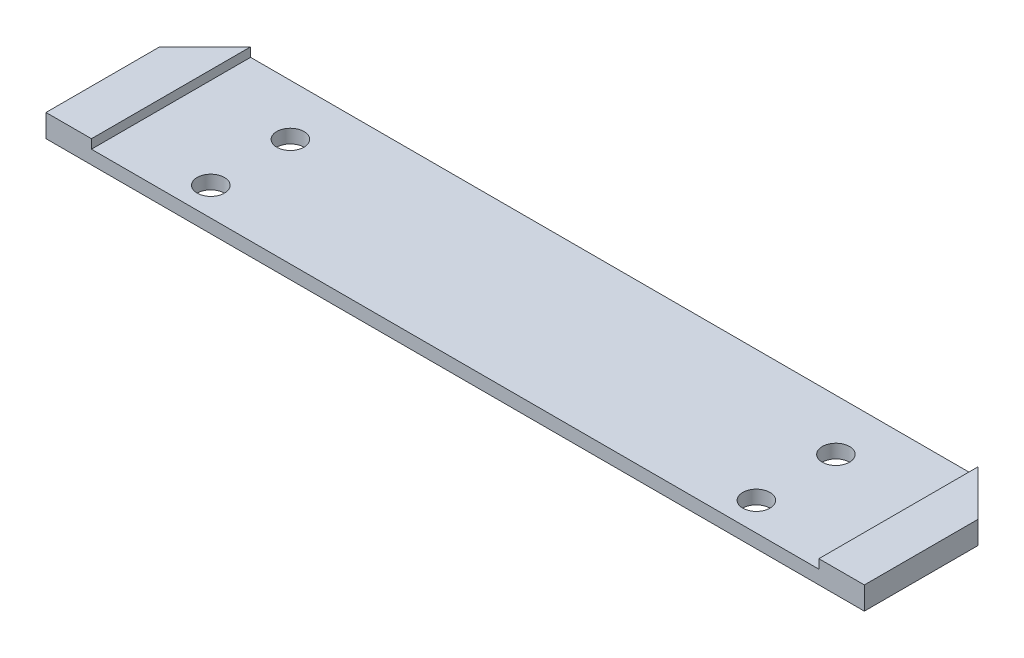
ISO-10303-21;
HEADER;
FILE_DESCRIPTION(('STEP AP214'),'2;1');
FILE_NAME('part.step','',(''),(''),'','','');
FILE_SCHEMA(('AUTOMOTIVE_DESIGN { 1 0 10303 214 1 1 1 1 }'));
ENDSEC;
DATA;
#1=APPLICATION_CONTEXT('core data for automotive mechanical design processes');
#2=APPLICATION_PROTOCOL_DEFINITION('international standard','automotive_design',2000,#1);
#3=PRODUCT_CONTEXT('',#1,'mechanical');
#4=PRODUCT('Part','Part','',(#3));
#5=PRODUCT_RELATED_PRODUCT_CATEGORY('part','',(#4));
#6=PRODUCT_DEFINITION_FORMATION('','',#4);
#7=PRODUCT_DEFINITION_CONTEXT('part definition',#1,'design');
#8=PRODUCT_DEFINITION('design','',#6,#7);
#9=PRODUCT_DEFINITION_SHAPE('','',#8);
#10=(LENGTH_UNIT() NAMED_UNIT(*) SI_UNIT(.MILLI.,.METRE.));
#11=(NAMED_UNIT(*) PLANE_ANGLE_UNIT() SI_UNIT($,.RADIAN.));
#12=(NAMED_UNIT(*) SI_UNIT($,.STERADIAN.) SOLID_ANGLE_UNIT());
#13=UNCERTAINTY_MEASURE_WITH_UNIT(LENGTH_MEASURE(1.E-05),#10,'distance_accuracy_value','');
#14=(GEOMETRIC_REPRESENTATION_CONTEXT(3) GLOBAL_UNCERTAINTY_ASSIGNED_CONTEXT((#13)) GLOBAL_UNIT_ASSIGNED_CONTEXT((#10,
#11,#12)) REPRESENTATION_CONTEXT('',''));
#15=CARTESIAN_POINT('',(0.,0.,0.));
#16=DIRECTION('',(0.,0.,1.));
#17=DIRECTION('',(1.,0.,0.));
#18=AXIS2_PLACEMENT_3D('',#15,#16,#17);
#19=CARTESIAN_POINT('',(-90.,5.,-17.5));
#20=DIRECTION('',(0.,0.,1.));
#21=DIRECTION('',(1.,0.,0.));
#22=AXIS2_PLACEMENT_3D('',#19,#20,#21);
#23=PLANE('',#22);
#24=DIRECTION('',(-1.,0.,0.));
#25=VECTOR('',#24,1.);
#26=CARTESIAN_POINT('',(0.,3.,-17.5));
#27=LINE('',#26,#25);
#28=CARTESIAN_POINT('',(79.9999999999999,3.,-17.5));
#29=VERTEX_POINT('',#28);
#30=CARTESIAN_POINT('',(-80.,3.,-17.5));
#31=VERTEX_POINT('',#30);
#32=EDGE_CURVE('E137',#29,#31,#27,.T.);
#33=ORIENTED_EDGE('',*,*,#32,.F.);
#34=DIRECTION('',(0.,-1.,0.));
#35=VECTOR('',#34,1.);
#36=CARTESIAN_POINT('',(80.,5.,-17.5));
#37=LINE('',#36,#35);
#38=CARTESIAN_POINT('',(79.9999999999999,0.,-17.5));
#39=VERTEX_POINT('',#38);
#40=EDGE_CURVE('E108',#29,#39,#37,.T.);
#41=ORIENTED_EDGE('',*,*,#40,.T.);
#42=DIRECTION('',(-1.,0.,0.));
#43=VECTOR('',#42,1.);
#44=CARTESIAN_POINT('',(-90.,0.,-17.5));
#45=LINE('',#44,#43);
#46=CARTESIAN_POINT('',(-80.,0.,-17.5));
#47=VERTEX_POINT('',#46);
#48=EDGE_CURVE('E194',#39,#47,#45,.T.);
#49=ORIENTED_EDGE('',*,*,#48,.T.);
#50=DIRECTION('',(0.,1.,0.));
#51=VECTOR('',#50,1.);
#52=CARTESIAN_POINT('',(-80.,5.,-17.5));
#53=LINE('',#52,#51);
#54=EDGE_CURVE('E119',#47,#31,#53,.T.);
#55=ORIENTED_EDGE('',*,*,#54,.T.);
#56=EDGE_LOOP('',(#33,#41,#49,#55));
#57=FACE_BOUND('',#56,.T.);
#58=ADVANCED_FACE('F35',(#57),#23,.F.);
#59=CARTESIAN_POINT('',(-90.,5.,17.5));
#60=DIRECTION('',(0.,0.,-1.));
#61=DIRECTION('',(-1.,0.,0.));
#62=AXIS2_PLACEMENT_3D('',#59,#60,#61);
#63=PLANE('',#62);
#64=DIRECTION('',(0.,1.,0.));
#65=VECTOR('',#64,1.);
#66=CARTESIAN_POINT('',(80.,3.,17.5));
#67=LINE('',#66,#65);
#68=CARTESIAN_POINT('',(80.,3.,17.5));
#69=VERTEX_POINT('',#68);
#70=CARTESIAN_POINT('',(80.,5.,17.5));
#71=VERTEX_POINT('',#70);
#72=EDGE_CURVE('E164',#69,#71,#67,.T.);
#73=ORIENTED_EDGE('',*,*,#72,.F.);
#74=DIRECTION('',(1.,0.,0.));
#75=VECTOR('',#74,1.);
#76=CARTESIAN_POINT('',(0.,3.,17.5));
#77=LINE('',#76,#75);
#78=CARTESIAN_POINT('',(-80.,3.,17.5));
#79=VERTEX_POINT('',#78);
#80=EDGE_CURVE('E140',#79,#69,#77,.T.);
#81=ORIENTED_EDGE('',*,*,#80,.F.);
#82=DIRECTION('',(0.,1.,0.));
#83=VECTOR('',#82,1.);
#84=CARTESIAN_POINT('',(-80.,3.,17.5));
#85=LINE('',#84,#83);
#86=CARTESIAN_POINT('',(-80.,5.,17.5));
#87=VERTEX_POINT('',#86);
#88=EDGE_CURVE('E167',#79,#87,#85,.T.);
#89=ORIENTED_EDGE('',*,*,#88,.T.);
#90=DIRECTION('',(1.,0.,0.));
#91=VECTOR('',#90,1.);
#92=CARTESIAN_POINT('',(-90.,5.,17.5));
#93=LINE('',#92,#91);
#94=CARTESIAN_POINT('',(-90.,5.,17.5));
#95=VERTEX_POINT('',#94);
#96=EDGE_CURVE('E189',#95,#87,#93,.T.);
#97=ORIENTED_EDGE('',*,*,#96,.F.);
#98=DIRECTION('',(0.,-1.,0.));
#99=VECTOR('',#98,1.);
#100=CARTESIAN_POINT('',(-90.,5.,17.5));
#101=LINE('',#100,#99);
#102=CARTESIAN_POINT('',(-90.,0.,17.5));
#103=VERTEX_POINT('',#102);
#104=EDGE_CURVE('E201',#95,#103,#101,.T.);
#105=ORIENTED_EDGE('',*,*,#104,.T.);
#106=DIRECTION('',(1.,0.,0.));
#107=VECTOR('',#106,1.);
#108=CARTESIAN_POINT('',(-90.,0.,17.5));
#109=LINE('',#108,#107);
#110=CARTESIAN_POINT('',(90.,0.,17.5));
#111=VERTEX_POINT('',#110);
#112=EDGE_CURVE('E186',#103,#111,#109,.T.);
#113=ORIENTED_EDGE('',*,*,#112,.T.);
#114=DIRECTION('',(0.,-1.,0.));
#115=VECTOR('',#114,1.);
#116=CARTESIAN_POINT('',(90.,5.,17.5));
#117=LINE('',#116,#115);
#118=CARTESIAN_POINT('',(90.,5.,17.5));
#119=VERTEX_POINT('',#118);
#120=EDGE_CURVE('E192',#119,#111,#117,.T.);
#121=ORIENTED_EDGE('',*,*,#120,.F.);
#122=EDGE_CURVE('E188',#71,#119,#93,.T.);
#123=ORIENTED_EDGE('',*,*,#122,.F.);
#124=EDGE_LOOP('',(#73,#81,#89,#97,#105,#113,#121,#123));
#125=FACE_BOUND('',#124,.T.);
#126=ADVANCED_FACE('F222',(#125),#63,.F.);
#127=CARTESIAN_POINT('',(0.,5.,0.));
#128=DIRECTION('',(0.,-1.,0.));
#129=DIRECTION('',(0.,0.,-1.));
#130=AXIS2_PLACEMENT_3D('',#127,#128,#129);
#131=PLANE('',#130);
#132=DIRECTION('',(0.,0.,-1.));
#133=VECTOR('',#132,1.);
#134=CARTESIAN_POINT('',(90.,5.,17.5));
#135=LINE('',#134,#133);
#136=CARTESIAN_POINT('',(90.,5.,-7.49999999999997));
#137=VERTEX_POINT('',#136);
#138=EDGE_CURVE('E183',#119,#137,#135,.T.);
#139=ORIENTED_EDGE('',*,*,#138,.T.);
#140=DIRECTION('',(0.707106781186546,0.,0.70710678118655));
#141=VECTOR('',#140,1.);
#142=CARTESIAN_POINT('',(80.,5.,-17.5));
#143=LINE('',#142,#141);
#144=CARTESIAN_POINT('',(79.9999999999999,5.,-17.5));
#145=VERTEX_POINT('',#144);
#146=EDGE_CURVE('E208',#137,#145,#143,.F.);
#147=ORIENTED_EDGE('',*,*,#146,.T.);
#148=DIRECTION('',(0.,0.,1.));
#149=VECTOR('',#148,1.);
#150=CARTESIAN_POINT('',(80.,5.,0.));
#151=LINE('',#150,#149);
#152=EDGE_CURVE('E128',#145,#71,#151,.T.);
#153=ORIENTED_EDGE('',*,*,#152,.T.);
#154=ORIENTED_EDGE('',*,*,#122,.T.);
#155=EDGE_LOOP('',(#139,#147,#153,#154));
#156=FACE_BOUND('',#155,.T.);
#157=ADVANCED_FACE('F227',(#156),#131,.F.);
#158=CARTESIAN_POINT('',(60.,5.,11.25));
#159=DIRECTION('',(0.,1.,0.));
#160=DIRECTION('',(0.,0.,1.));
#161=AXIS2_PLACEMENT_3D('',#158,#159,#160);
#162=CYLINDRICAL_SURFACE('',#161,2.99999999999999);
#163=CARTESIAN_POINT('',(60.,0.,11.25));
#164=DIRECTION('',(0.,1.,0.));
#165=DIRECTION('',(0.,0.,1.));
#166=AXIS2_PLACEMENT_3D('',#163,#164,#165);
#167=CIRCLE('',#166,2.99999999999999);
#168=CARTESIAN_POINT('',(60.,0.,14.25));
#169=VERTEX_POINT('',#168);
#170=EDGE_CURVE('E179',#169,#169,#167,.T.);
#171=ORIENTED_EDGE('',*,*,#170,.F.);
#172=EDGE_LOOP('',(#171));
#173=FACE_BOUND('',#172,.T.);
#174=CARTESIAN_POINT('',(60.,3.,11.25));
#175=DIRECTION('',(0.,1.,0.));
#176=DIRECTION('',(0.,0.,1.));
#177=AXIS2_PLACEMENT_3D('',#174,#175,#176);
#178=CIRCLE('',#177,2.99999999999999);
#179=CARTESIAN_POINT('',(60.,3.,14.25));
#180=VERTEX_POINT('',#179);
#181=EDGE_CURVE('E154',#180,#180,#178,.F.);
#182=ORIENTED_EDGE('',*,*,#181,.F.);
#183=EDGE_LOOP('',(#182));
#184=FACE_BOUND('',#183,.T.);
#185=ADVANCED_FACE('F319',(#173,#184),#162,.F.);
#186=CARTESIAN_POINT('',(60.,5.,-6.25));
#187=DIRECTION('',(0.,1.,0.));
#188=DIRECTION('',(0.,0.,1.));
#189=AXIS2_PLACEMENT_3D('',#186,#187,#188);
#190=CYLINDRICAL_SURFACE('',#189,2.99999999999999);
#191=CARTESIAN_POINT('',(60.,0.,-6.25));
#192=DIRECTION('',(0.,1.,0.));
#193=DIRECTION('',(0.,0.,1.));
#194=AXIS2_PLACEMENT_3D('',#191,#192,#193);
#195=CIRCLE('',#194,2.99999999999999);
#196=CARTESIAN_POINT('',(60.,0.,-3.25000000000001));
#197=VERTEX_POINT('',#196);
#198=EDGE_CURVE('E176',#197,#197,#195,.T.);
#199=ORIENTED_EDGE('',*,*,#198,.F.);
#200=EDGE_LOOP('',(#199));
#201=FACE_BOUND('',#200,.T.);
#202=CARTESIAN_POINT('',(60.,3.,-6.25));
#203=DIRECTION('',(0.,1.,0.));
#204=DIRECTION('',(0.,0.,1.));
#205=AXIS2_PLACEMENT_3D('',#202,#203,#204);
#206=CIRCLE('',#205,2.99999999999999);
#207=CARTESIAN_POINT('',(60.,3.,-3.25000000000001));
#208=VERTEX_POINT('',#207);
#209=EDGE_CURVE('E157',#208,#208,#206,.F.);
#210=ORIENTED_EDGE('',*,*,#209,.F.);
#211=EDGE_LOOP('',(#210));
#212=FACE_BOUND('',#211,.T.);
#213=ADVANCED_FACE('F342',(#201,#212),#190,.F.);
#214=CARTESIAN_POINT('',(-60.,5.,11.25));
#215=DIRECTION('',(0.,1.,0.));
#216=DIRECTION('',(0.,0.,1.));
#217=AXIS2_PLACEMENT_3D('',#214,#215,#216);
#218=CYLINDRICAL_SURFACE('',#217,2.99999999999999);
#219=CARTESIAN_POINT('',(-60.,0.,11.25));
#220=DIRECTION('',(0.,1.,0.));
#221=DIRECTION('',(0.,0.,1.));
#222=AXIS2_PLACEMENT_3D('',#219,#220,#221);
#223=CIRCLE('',#222,2.99999999999999);
#224=CARTESIAN_POINT('',(-60.,0.,14.25));
#225=VERTEX_POINT('',#224);
#226=EDGE_CURVE('E173',#225,#225,#223,.T.);
#227=ORIENTED_EDGE('',*,*,#226,.F.);
#228=EDGE_LOOP('',(#227));
#229=FACE_BOUND('',#228,.T.);
#230=CARTESIAN_POINT('',(-60.,3.,11.25));
#231=DIRECTION('',(0.,1.,0.));
#232=DIRECTION('',(0.,0.,1.));
#233=AXIS2_PLACEMENT_3D('',#230,#231,#232);
#234=CIRCLE('',#233,2.99999999999999);
#235=CARTESIAN_POINT('',(-60.,3.,14.25));
#236=VERTEX_POINT('',#235);
#237=EDGE_CURVE('E151',#236,#236,#234,.F.);
#238=ORIENTED_EDGE('',*,*,#237,.F.);
#239=EDGE_LOOP('',(#238));
#240=FACE_BOUND('',#239,.T.);
#241=ADVANCED_FACE('F332',(#229,#240),#218,.F.);
#242=CARTESIAN_POINT('',(-60.,5.,-6.25));
#243=DIRECTION('',(0.,1.,0.));
#244=DIRECTION('',(0.,0.,1.));
#245=AXIS2_PLACEMENT_3D('',#242,#243,#244);
#246=CYLINDRICAL_SURFACE('',#245,2.99999999999999);
#247=CARTESIAN_POINT('',(-60.,0.,-6.25));
#248=DIRECTION('',(0.,1.,0.));
#249=DIRECTION('',(0.,0.,1.));
#250=AXIS2_PLACEMENT_3D('',#247,#248,#249);
#251=CIRCLE('',#250,2.99999999999999);
#252=CARTESIAN_POINT('',(-60.,0.,-3.25000000000001));
#253=VERTEX_POINT('',#252);
#254=EDGE_CURVE('E166',#253,#253,#251,.T.);
#255=ORIENTED_EDGE('',*,*,#254,.F.);
#256=EDGE_LOOP('',(#255));
#257=FACE_BOUND('',#256,.T.);
#258=CARTESIAN_POINT('',(-60.,3.,-6.25));
#259=DIRECTION('',(0.,1.,0.));
#260=DIRECTION('',(0.,0.,1.));
#261=AXIS2_PLACEMENT_3D('',#258,#259,#260);
#262=CIRCLE('',#261,2.99999999999999);
#263=CARTESIAN_POINT('',(-60.,3.,-3.25000000000001));
#264=VERTEX_POINT('',#263);
#265=EDGE_CURVE('E130',#264,#264,#262,.F.);
#266=ORIENTED_EDGE('',*,*,#265,.F.);
#267=EDGE_LOOP('',(#266));
#268=FACE_BOUND('',#267,.T.);
#269=ADVANCED_FACE('F248',(#257,#268),#246,.F.);
#270=CARTESIAN_POINT('',(90.,5.,17.5));
#271=DIRECTION('',(-1.,0.,0.));
#272=DIRECTION('',(0.,0.,1.));
#273=AXIS2_PLACEMENT_3D('',#270,#271,#272);
#274=PLANE('',#273);
#275=DIRECTION('',(0.,0.,-1.));
#276=VECTOR('',#275,1.);
#277=CARTESIAN_POINT('',(90.,0.,17.5));
#278=LINE('',#277,#276);
#279=CARTESIAN_POINT('',(90.,0.,-7.49999999999997));
#280=VERTEX_POINT('',#279);
#281=EDGE_CURVE('E182',#111,#280,#278,.T.);
#282=ORIENTED_EDGE('',*,*,#281,.T.);
#283=DIRECTION('',(0.,1.,0.));
#284=VECTOR('',#283,1.);
#285=CARTESIAN_POINT('',(90.,5.,-7.49999999999997));
#286=LINE('',#285,#284);
#287=EDGE_CURVE('E57',#280,#137,#286,.T.);
#288=ORIENTED_EDGE('',*,*,#287,.T.);
#289=ORIENTED_EDGE('',*,*,#138,.F.);
#290=ORIENTED_EDGE('',*,*,#120,.T.);
#291=EDGE_LOOP('',(#282,#288,#289,#290));
#292=FACE_BOUND('',#291,.T.);
#293=ADVANCED_FACE('F225',(#292),#274,.F.);
#294=CARTESIAN_POINT('',(-90.,5.,17.5));
#295=DIRECTION('',(1.,0.,0.));
#296=DIRECTION('',(0.,0.,-1.));
#297=AXIS2_PLACEMENT_3D('',#294,#295,#296);
#298=PLANE('',#297);
#299=DIRECTION('',(0.,0.,1.));
#300=VECTOR('',#299,1.);
#301=CARTESIAN_POINT('',(-90.,5.,17.5));
#302=LINE('',#301,#300);
#303=CARTESIAN_POINT('',(-90.,5.,-7.49999999999997));
#304=VERTEX_POINT('',#303);
#305=EDGE_CURVE('E185',#304,#95,#302,.T.);
#306=ORIENTED_EDGE('',*,*,#305,.F.);
#307=DIRECTION('',(0.,-1.,0.));
#308=VECTOR('',#307,1.);
#309=CARTESIAN_POINT('',(-90.,5.,-7.49999999999997));
#310=LINE('',#309,#308);
#311=CARTESIAN_POINT('',(-90.,0.,-7.49999999999997));
#312=VERTEX_POINT('',#311);
#313=EDGE_CURVE('E44',#304,#312,#310,.T.);
#314=ORIENTED_EDGE('',*,*,#313,.T.);
#315=DIRECTION('',(0.,0.,1.));
#316=VECTOR('',#315,1.);
#317=CARTESIAN_POINT('',(-90.,0.,17.5));
#318=LINE('',#317,#316);
#319=EDGE_CURVE('E196',#312,#103,#318,.T.);
#320=ORIENTED_EDGE('',*,*,#319,.T.);
#321=ORIENTED_EDGE('',*,*,#104,.F.);
#322=EDGE_LOOP('',(#306,#314,#320,#321));
#323=FACE_BOUND('',#322,.T.);
#324=ADVANCED_FACE('F213',(#323),#298,.F.);
#325=DIRECTION('',(0.,0.,1.));
#326=VECTOR('',#325,1.);
#327=CARTESIAN_POINT('',(-80.,5.,0.));
#328=LINE('',#327,#326);
#329=CARTESIAN_POINT('',(-80.,5.,-17.5));
#330=VERTEX_POINT('',#329);
#331=EDGE_CURVE('E142',#330,#87,#328,.T.);
#332=ORIENTED_EDGE('',*,*,#331,.F.);
#333=DIRECTION('',(0.707106781186549,0.,-0.707106781186547));
#334=VECTOR('',#333,1.);
#335=CARTESIAN_POINT('',(-90.,5.,-7.49999999999997));
#336=LINE('',#335,#334);
#337=EDGE_CURVE('E11',#330,#304,#336,.F.);
#338=ORIENTED_EDGE('',*,*,#337,.T.);
#339=ORIENTED_EDGE('',*,*,#305,.T.);
#340=ORIENTED_EDGE('',*,*,#96,.T.);
#341=EDGE_LOOP('',(#332,#338,#339,#340));
#342=FACE_BOUND('',#341,.T.);
#343=ADVANCED_FACE('F229',(#342),#131,.F.);
#344=CARTESIAN_POINT('',(0.,0.,0.));
#345=DIRECTION('',(0.,-1.,0.));
#346=DIRECTION('',(0.,0.,-1.));
#347=AXIS2_PLACEMENT_3D('',#344,#345,#346);
#348=PLANE('',#347);
#349=ORIENTED_EDGE('',*,*,#254,.T.);
#350=EDGE_LOOP('',(#349));
#351=FACE_BOUND('',#350,.T.);
#352=ORIENTED_EDGE('',*,*,#226,.T.);
#353=EDGE_LOOP('',(#352));
#354=FACE_BOUND('',#353,.T.);
#355=ORIENTED_EDGE('',*,*,#198,.T.);
#356=EDGE_LOOP('',(#355));
#357=FACE_BOUND('',#356,.T.);
#358=ORIENTED_EDGE('',*,*,#170,.T.);
#359=EDGE_LOOP('',(#358));
#360=FACE_BOUND('',#359,.T.);
#361=ORIENTED_EDGE('',*,*,#48,.F.);
#362=DIRECTION('',(-0.707106781186546,0.,-0.70710678118655));
#363=VECTOR('',#362,1.);
#364=CARTESIAN_POINT('',(48.7500000000002,0.,-48.7499999999999));
#365=LINE('',#364,#363);
#366=EDGE_CURVE('E113',#39,#280,#365,.F.);
#367=ORIENTED_EDGE('',*,*,#366,.T.);
#368=ORIENTED_EDGE('',*,*,#281,.F.);
#369=ORIENTED_EDGE('',*,*,#112,.F.);
#370=ORIENTED_EDGE('',*,*,#319,.F.);
#371=DIRECTION('',(-0.707106781186549,0.,0.707106781186547));
#372=VECTOR('',#371,1.);
#373=CARTESIAN_POINT('',(-48.7499999999999,0.,-48.75));
#374=LINE('',#373,#372);
#375=EDGE_CURVE('E118',#312,#47,#374,.F.);
#376=ORIENTED_EDGE('',*,*,#375,.T.);
#377=EDGE_LOOP('',(#361,#367,#368,#369,#370,#376));
#378=FACE_BOUND('',#377,.T.);
#379=ADVANCED_FACE('F218',(#351,#354,#357,#360,#378),#348,.T.);
#380=CARTESIAN_POINT('',(80.,3.,0.));
#381=DIRECTION('',(-1.,0.,0.));
#382=DIRECTION('',(0.,0.,1.));
#383=AXIS2_PLACEMENT_3D('',#380,#381,#382);
#384=PLANE('',#383);
#385=ORIENTED_EDGE('',*,*,#152,.F.);
#386=DIRECTION('',(0.,1.,0.));
#387=VECTOR('',#386,1.);
#388=CARTESIAN_POINT('',(79.9999999999999,3.,-17.5));
#389=LINE('',#388,#387);
#390=EDGE_CURVE('E112',#29,#145,#389,.T.);
#391=ORIENTED_EDGE('',*,*,#390,.F.);
#392=DIRECTION('',(0.,0.,1.));
#393=VECTOR('',#392,1.);
#394=CARTESIAN_POINT('',(80.,3.,0.));
#395=LINE('',#394,#393);
#396=EDGE_CURVE('E125',#29,#69,#395,.T.);
#397=ORIENTED_EDGE('',*,*,#396,.T.);
#398=ORIENTED_EDGE('',*,*,#72,.T.);
#399=EDGE_LOOP('',(#385,#391,#397,#398));
#400=FACE_BOUND('',#399,.T.);
#401=ADVANCED_FACE('F124',(#400),#384,.T.);
#402=CARTESIAN_POINT('',(-80.,3.,0.));
#403=DIRECTION('',(-1.,0.,0.));
#404=DIRECTION('',(0.,0.,1.));
#405=AXIS2_PLACEMENT_3D('',#402,#403,#404);
#406=PLANE('',#405);
#407=ORIENTED_EDGE('',*,*,#331,.T.);
#408=ORIENTED_EDGE('',*,*,#88,.F.);
#409=DIRECTION('',(0.,0.,1.));
#410=VECTOR('',#409,1.);
#411=CARTESIAN_POINT('',(-80.,3.,0.));
#412=LINE('',#411,#410);
#413=EDGE_CURVE('E146',#31,#79,#412,.T.);
#414=ORIENTED_EDGE('',*,*,#413,.F.);
#415=DIRECTION('',(0.,1.,0.));
#416=VECTOR('',#415,1.);
#417=CARTESIAN_POINT('',(-80.,3.,-17.5));
#418=LINE('',#417,#416);
#419=EDGE_CURVE('E129',#31,#330,#418,.T.);
#420=ORIENTED_EDGE('',*,*,#419,.T.);
#421=EDGE_LOOP('',(#407,#408,#414,#420));
#422=FACE_BOUND('',#421,.T.);
#423=ADVANCED_FACE('F230',(#422),#406,.F.);
#424=CARTESIAN_POINT('',(0.,3.,0.));
#425=DIRECTION('',(0.,1.,0.));
#426=DIRECTION('',(0.,0.,1.));
#427=AXIS2_PLACEMENT_3D('',#424,#425,#426);
#428=PLANE('',#427);
#429=ORIENTED_EDGE('',*,*,#396,.F.);
#430=ORIENTED_EDGE('',*,*,#32,.T.);
#431=ORIENTED_EDGE('',*,*,#413,.T.);
#432=ORIENTED_EDGE('',*,*,#80,.T.);
#433=EDGE_LOOP('',(#429,#430,#431,#432));
#434=FACE_BOUND('',#433,.T.);
#435=ORIENTED_EDGE('',*,*,#237,.T.);
#436=EDGE_LOOP('',(#435));
#437=FACE_BOUND('',#436,.T.);
#438=ORIENTED_EDGE('',*,*,#181,.T.);
#439=EDGE_LOOP('',(#438));
#440=FACE_BOUND('',#439,.T.);
#441=ORIENTED_EDGE('',*,*,#209,.T.);
#442=EDGE_LOOP('',(#441));
#443=FACE_BOUND('',#442,.T.);
#444=ORIENTED_EDGE('',*,*,#265,.T.);
#445=EDGE_LOOP('',(#444));
#446=FACE_BOUND('',#445,.T.);
#447=ADVANCED_FACE('F134',(#434,#437,#440,#443,#446),#428,.T.);
#448=CARTESIAN_POINT('',(80.,5.,-17.5));
#449=DIRECTION('',(-0.707106781186549,0.,0.707106781186545));
#450=DIRECTION('',(0.,-1.,0.));
#451=AXIS2_PLACEMENT_3D('',#448,#449,#450);
#452=PLANE('',#451);
#453=ORIENTED_EDGE('',*,*,#146,.F.);
#454=ORIENTED_EDGE('',*,*,#287,.F.);
#455=ORIENTED_EDGE('',*,*,#366,.F.);
#456=ORIENTED_EDGE('',*,*,#40,.F.);
#457=ORIENTED_EDGE('',*,*,#390,.T.);
#458=EDGE_LOOP('',(#453,#454,#455,#456,#457));
#459=FACE_BOUND('',#458,.T.);
#460=ADVANCED_FACE('F111',(#459),#452,.F.);
#461=CARTESIAN_POINT('',(-90.,5.,-7.49999999999997));
#462=DIRECTION('',(0.707106781186546,0.,0.707106781186548));
#463=DIRECTION('',(0.,-1.,0.));
#464=AXIS2_PLACEMENT_3D('',#461,#462,#463);
#465=PLANE('',#464);
#466=ORIENTED_EDGE('',*,*,#419,.F.);
#467=ORIENTED_EDGE('',*,*,#54,.F.);
#468=ORIENTED_EDGE('',*,*,#375,.F.);
#469=ORIENTED_EDGE('',*,*,#313,.F.);
#470=ORIENTED_EDGE('',*,*,#337,.F.);
#471=EDGE_LOOP('',(#466,#467,#468,#469,#470));
#472=FACE_BOUND('',#471,.T.);
#473=ADVANCED_FACE('F38',(#472),#465,.F.);
#474=CLOSED_SHELL('',(#58,#126,#157,#185,#213,#241,#269,#293,#324,#343,#379,#401,#423,#447,#460,#473));
#475=MANIFOLD_SOLID_BREP('B2',#474);
#476=ADVANCED_BREP_SHAPE_REPRESENTATION('',(#18,#475),#14);
#477=SHAPE_DEFINITION_REPRESENTATION(#9,#476);
ENDSEC;
END-ISO-10303-21;
